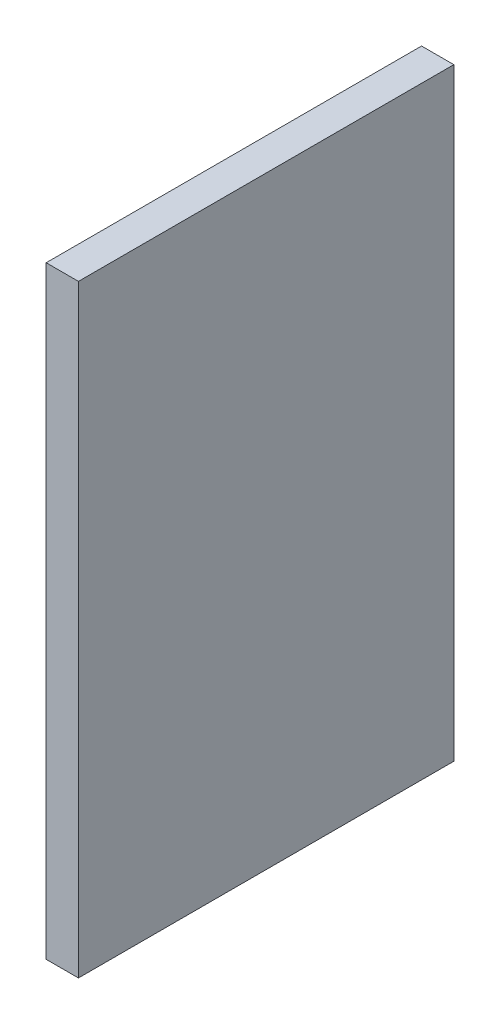
ISO-10303-21;
HEADER;
FILE_DESCRIPTION(('STEP AP214'),'2;1');
FILE_NAME('part.step','',(''),(''),'','','');
FILE_SCHEMA(('AUTOMOTIVE_DESIGN { 1 0 10303 214 1 1 1 1 }'));
ENDSEC;
DATA;
#1=APPLICATION_CONTEXT('core data for automotive mechanical design processes');
#2=APPLICATION_PROTOCOL_DEFINITION('international standard','automotive_design',2000,#1);
#3=PRODUCT_CONTEXT('',#1,'mechanical');
#4=PRODUCT('Part','Part','',(#3));
#5=PRODUCT_RELATED_PRODUCT_CATEGORY('part','',(#4));
#6=PRODUCT_DEFINITION_FORMATION('','',#4);
#7=PRODUCT_DEFINITION_CONTEXT('part definition',#1,'design');
#8=PRODUCT_DEFINITION('design','',#6,#7);
#9=PRODUCT_DEFINITION_SHAPE('','',#8);
#10=(LENGTH_UNIT() NAMED_UNIT(*) SI_UNIT(.MILLI.,.METRE.));
#11=(NAMED_UNIT(*) PLANE_ANGLE_UNIT() SI_UNIT($,.RADIAN.));
#12=(NAMED_UNIT(*) SI_UNIT($,.STERADIAN.) SOLID_ANGLE_UNIT());
#13=UNCERTAINTY_MEASURE_WITH_UNIT(LENGTH_MEASURE(1.E-05),#10,'distance_accuracy_value','');
#14=(GEOMETRIC_REPRESENTATION_CONTEXT(3) GLOBAL_UNCERTAINTY_ASSIGNED_CONTEXT((#13)) GLOBAL_UNIT_ASSIGNED_CONTEXT((#10,
#11,#12)) REPRESENTATION_CONTEXT('',''));
#15=CARTESIAN_POINT('',(0.,0.,0.));
#16=DIRECTION('',(0.,0.,1.));
#17=DIRECTION('',(1.,0.,0.));
#18=AXIS2_PLACEMENT_3D('',#15,#16,#17);
#19=CARTESIAN_POINT('',(2.408,45.,0.));
#20=DIRECTION('',(0.,0.,-1.));
#21=DIRECTION('',(-1.,0.,0.));
#22=AXIS2_PLACEMENT_3D('',#19,#20,#21);
#23=PLANE('',#22);
#24=DIRECTION('',(0.,-1.,0.));
#25=VECTOR('',#24,1.);
#26=CARTESIAN_POINT('',(0.,45.,0.));
#27=LINE('',#26,#25);
#28=CARTESIAN_POINT('',(0.,45.,0.));
#29=VERTEX_POINT('',#28);
#30=CARTESIAN_POINT('',(0.,0.,0.));
#31=VERTEX_POINT('',#30);
#32=EDGE_CURVE('E73',#29,#31,#27,.T.);
#33=ORIENTED_EDGE('',*,*,#32,.T.);
#34=DIRECTION('',(-1.,0.,0.));
#35=VECTOR('',#34,1.);
#36=CARTESIAN_POINT('',(2.408,0.,0.));
#37=LINE('',#36,#35);
#38=CARTESIAN_POINT('',(2.408,0.,0.));
#39=VERTEX_POINT('',#38);
#40=EDGE_CURVE('E11',#39,#31,#37,.T.);
#41=ORIENTED_EDGE('',*,*,#40,.F.);
#42=DIRECTION('',(0.,-1.,0.));
#43=VECTOR('',#42,1.);
#44=CARTESIAN_POINT('',(2.408,45.,0.));
#45=LINE('',#44,#43);
#46=CARTESIAN_POINT('',(2.408,45.,0.));
#47=VERTEX_POINT('',#46);
#48=EDGE_CURVE('E91',#47,#39,#45,.T.);
#49=ORIENTED_EDGE('',*,*,#48,.F.);
#50=DIRECTION('',(-1.,0.,0.));
#51=VECTOR('',#50,1.);
#52=CARTESIAN_POINT('',(2.408,45.,0.));
#53=LINE('',#52,#51);
#54=EDGE_CURVE('E85',#47,#29,#53,.T.);
#55=ORIENTED_EDGE('',*,*,#54,.T.);
#56=EDGE_LOOP('',(#33,#41,#49,#55));
#57=FACE_BOUND('',#56,.T.);
#58=ADVANCED_FACE('F29',(#57),#23,.F.);
#59=CARTESIAN_POINT('',(2.408,0.,0.));
#60=DIRECTION('',(0.,1.,0.));
#61=DIRECTION('',(0.,0.,1.));
#62=AXIS2_PLACEMENT_3D('',#59,#60,#61);
#63=PLANE('',#62);
#64=DIRECTION('',(0.,0.,-1.));
#65=VECTOR('',#64,1.);
#66=CARTESIAN_POINT('',(0.,0.,0.));
#67=LINE('',#66,#65);
#68=CARTESIAN_POINT('',(0.,0.,-28.));
#69=VERTEX_POINT('',#68);
#70=EDGE_CURVE('E69',#31,#69,#67,.T.);
#71=ORIENTED_EDGE('',*,*,#70,.T.);
#72=DIRECTION('',(-1.,0.,0.));
#73=VECTOR('',#72,1.);
#74=CARTESIAN_POINT('',(2.408,0.,-28.));
#75=LINE('',#74,#73);
#76=CARTESIAN_POINT('',(2.408,0.,-28.));
#77=VERTEX_POINT('',#76);
#78=EDGE_CURVE('E36',#77,#69,#75,.T.);
#79=ORIENTED_EDGE('',*,*,#78,.F.);
#80=DIRECTION('',(0.,0.,-1.));
#81=VECTOR('',#80,1.);
#82=CARTESIAN_POINT('',(2.408,0.,0.));
#83=LINE('',#82,#81);
#84=EDGE_CURVE('E81',#39,#77,#83,.T.);
#85=ORIENTED_EDGE('',*,*,#84,.F.);
#86=ORIENTED_EDGE('',*,*,#40,.T.);
#87=EDGE_LOOP('',(#71,#79,#85,#86));
#88=FACE_BOUND('',#87,.T.);
#89=ADVANCED_FACE('F80',(#88),#63,.F.);
#90=CARTESIAN_POINT('',(2.408,0.,-28.));
#91=DIRECTION('',(0.,0.,1.));
#92=DIRECTION('',(1.,0.,0.));
#93=AXIS2_PLACEMENT_3D('',#90,#91,#92);
#94=PLANE('',#93);
#95=DIRECTION('',(0.,1.,0.));
#96=VECTOR('',#95,1.);
#97=CARTESIAN_POINT('',(0.,0.,-28.));
#98=LINE('',#97,#96);
#99=CARTESIAN_POINT('',(0.,45.,-28.));
#100=VERTEX_POINT('',#99);
#101=EDGE_CURVE('E74',#69,#100,#98,.T.);
#102=ORIENTED_EDGE('',*,*,#101,.T.);
#103=DIRECTION('',(-1.,0.,0.));
#104=VECTOR('',#103,1.);
#105=CARTESIAN_POINT('',(2.408,45.,-28.));
#106=LINE('',#105,#104);
#107=CARTESIAN_POINT('',(2.408,45.,-28.));
#108=VERTEX_POINT('',#107);
#109=EDGE_CURVE('E97',#108,#100,#106,.T.);
#110=ORIENTED_EDGE('',*,*,#109,.F.);
#111=DIRECTION('',(0.,1.,0.));
#112=VECTOR('',#111,1.);
#113=CARTESIAN_POINT('',(2.408,0.,-28.));
#114=LINE('',#113,#112);
#115=EDGE_CURVE('E48',#77,#108,#114,.T.);
#116=ORIENTED_EDGE('',*,*,#115,.F.);
#117=ORIENTED_EDGE('',*,*,#78,.T.);
#118=EDGE_LOOP('',(#102,#110,#116,#117));
#119=FACE_BOUND('',#118,.T.);
#120=ADVANCED_FACE('F100',(#119),#94,.F.);
#121=CARTESIAN_POINT('',(2.408,45.,-28.));
#122=DIRECTION('',(0.,-1.,0.));
#123=DIRECTION('',(0.,0.,-1.));
#124=AXIS2_PLACEMENT_3D('',#121,#122,#123);
#125=PLANE('',#124);
#126=DIRECTION('',(0.,0.,1.));
#127=VECTOR('',#126,1.);
#128=CARTESIAN_POINT('',(0.,45.,-28.));
#129=LINE('',#128,#127);
#130=EDGE_CURVE('E89',#100,#29,#129,.T.);
#131=ORIENTED_EDGE('',*,*,#130,.T.);
#132=ORIENTED_EDGE('',*,*,#54,.F.);
#133=DIRECTION('',(0.,0.,1.));
#134=VECTOR('',#133,1.);
#135=CARTESIAN_POINT('',(2.408,45.,-28.));
#136=LINE('',#135,#134);
#137=EDGE_CURVE('E43',#108,#47,#136,.T.);
#138=ORIENTED_EDGE('',*,*,#137,.F.);
#139=ORIENTED_EDGE('',*,*,#109,.T.);
#140=EDGE_LOOP('',(#131,#132,#138,#139));
#141=FACE_BOUND('',#140,.T.);
#142=ADVANCED_FACE('F102',(#141),#125,.F.);
#143=CARTESIAN_POINT('',(2.408,0.,0.));
#144=DIRECTION('',(1.,0.,0.));
#145=DIRECTION('',(0.,0.,-1.));
#146=AXIS2_PLACEMENT_3D('',#143,#144,#145);
#147=PLANE('',#146);
#148=ORIENTED_EDGE('',*,*,#48,.T.);
#149=ORIENTED_EDGE('',*,*,#84,.T.);
#150=ORIENTED_EDGE('',*,*,#115,.T.);
#151=ORIENTED_EDGE('',*,*,#137,.T.);
#152=EDGE_LOOP('',(#148,#149,#150,#151));
#153=FACE_BOUND('',#152,.T.);
#154=ADVANCED_FACE('F103',(#153),#147,.T.);
#155=CARTESIAN_POINT('',(0.,0.,0.));
#156=DIRECTION('',(1.,0.,0.));
#157=DIRECTION('',(0.,0.,-1.));
#158=AXIS2_PLACEMENT_3D('',#155,#156,#157);
#159=PLANE('',#158);
#160=ORIENTED_EDGE('',*,*,#32,.F.);
#161=ORIENTED_EDGE('',*,*,#130,.F.);
#162=ORIENTED_EDGE('',*,*,#101,.F.);
#163=ORIENTED_EDGE('',*,*,#70,.F.);
#164=EDGE_LOOP('',(#160,#161,#162,#163));
#165=FACE_BOUND('',#164,.T.);
#166=ADVANCED_FACE('F70',(#165),#159,.F.);
#167=CLOSED_SHELL('',(#58,#89,#120,#142,#154,#166));
#168=MANIFOLD_SOLID_BREP('B2',#167);
#169=ADVANCED_BREP_SHAPE_REPRESENTATION('',(#18,#168),#14);
#170=SHAPE_DEFINITION_REPRESENTATION(#9,#169);
ENDSEC;
END-ISO-10303-21;
